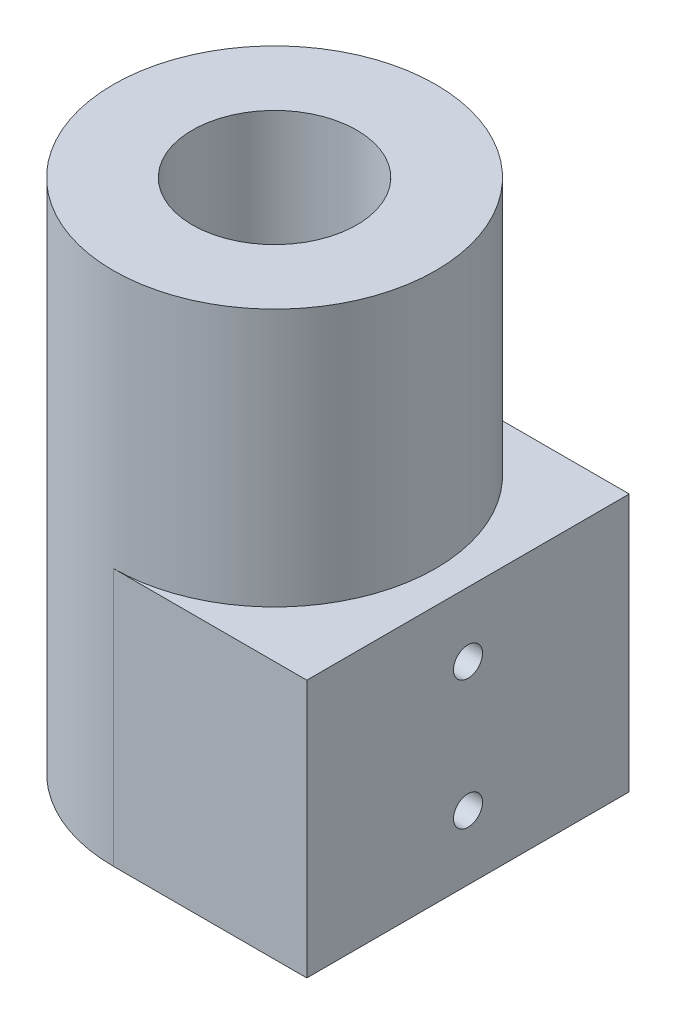
ISO-10303-21;
HEADER;
FILE_DESCRIPTION(('STEP AP214'),'2;1');
FILE_NAME('part.step','',(''),(''),'','','');
FILE_SCHEMA(('AUTOMOTIVE_DESIGN { 1 0 10303 214 1 1 1 1 }'));
ENDSEC;
DATA;
#1=APPLICATION_CONTEXT('core data for automotive mechanical design processes');
#2=APPLICATION_PROTOCOL_DEFINITION('international standard','automotive_design',2000,#1);
#3=PRODUCT_CONTEXT('',#1,'mechanical');
#4=PRODUCT('Part','Part','',(#3));
#5=PRODUCT_RELATED_PRODUCT_CATEGORY('part','',(#4));
#6=PRODUCT_DEFINITION_FORMATION('','',#4);
#7=PRODUCT_DEFINITION_CONTEXT('part definition',#1,'design');
#8=PRODUCT_DEFINITION('design','',#6,#7);
#9=PRODUCT_DEFINITION_SHAPE('','',#8);
#10=(LENGTH_UNIT() NAMED_UNIT(*) SI_UNIT(.MILLI.,.METRE.));
#11=(NAMED_UNIT(*) PLANE_ANGLE_UNIT() SI_UNIT($,.RADIAN.));
#12=(NAMED_UNIT(*) SI_UNIT($,.STERADIAN.) SOLID_ANGLE_UNIT());
#13=UNCERTAINTY_MEASURE_WITH_UNIT(LENGTH_MEASURE(1.E-05),#10,'distance_accuracy_value','');
#14=(GEOMETRIC_REPRESENTATION_CONTEXT(3) GLOBAL_UNCERTAINTY_ASSIGNED_CONTEXT((#13)) GLOBAL_UNIT_ASSIGNED_CONTEXT((#10,
#11,#12)) REPRESENTATION_CONTEXT('',''));
#15=CARTESIAN_POINT('',(0.,0.,0.));
#16=DIRECTION('',(0.,0.,1.));
#17=DIRECTION('',(1.,0.,0.));
#18=AXIS2_PLACEMENT_3D('',#15,#16,#17);
#19=CARTESIAN_POINT('',(0.,80.,0.));
#20=DIRECTION('',(0.,-1.,0.));
#21=DIRECTION('',(0.,0.,-1.));
#22=AXIS2_PLACEMENT_3D('',#19,#20,#21);
#23=CYLINDRICAL_SURFACE('',#22,25.);
#24=CARTESIAN_POINT('',(0.,80.,0.));
#25=DIRECTION('',(0.,1.,0.));
#26=DIRECTION('',(0.,0.,1.));
#27=AXIS2_PLACEMENT_3D('',#24,#25,#26);
#28=CIRCLE('',#27,25.);
#29=CARTESIAN_POINT('',(0.,80.,25.));
#30=VERTEX_POINT('',#29);
#31=EDGE_CURVE('E11',#30,#30,#28,.T.);
#32=ORIENTED_EDGE('',*,*,#31,.F.);
#33=EDGE_LOOP('',(#32));
#34=FACE_BOUND('',#33,.T.);
#35=CARTESIAN_POINT('',(-25.,8.6,0.));
#36=CARTESIAN_POINT('',(-24.9999994770471,8.60000346301199,-0.0785725456920296));
#37=CARTESIAN_POINT('',(-24.9996256167221,8.60663684055224,-0.15720049377424));
#38=CARTESIAN_POINT('',(-24.9981701556196,8.63300411119065,-0.312286405545781));
#39=CARTESIAN_POINT('',(-24.9970877255648,8.65275335488369,-0.388741716949364));
#40=CARTESIAN_POINT('',(-24.9943376103228,8.7047843242062,-0.537213404531629));
#41=CARTESIAN_POINT('',(-24.9926702281788,8.73705956147251,-0.609232056520927));
#42=CARTESIAN_POINT('',(-24.9889378814737,8.81321612143035,-0.746810262159747));
#43=CARTESIAN_POINT('',(-24.9868730095291,8.85709474138223,-0.812371315083188));
#44=CARTESIAN_POINT('',(-24.9825750435397,8.95527212765631,-0.935273182744505));
#45=CARTESIAN_POINT('',(-24.9803417700047,9.00958211035557,-0.992605031979624));
#46=CARTESIAN_POINT('',(-24.9759602441916,9.12705777265316,-1.09734450674776));
#47=CARTESIAN_POINT('',(-24.9738119954254,9.19022381753946,-1.14475172271603));
#48=CARTESIAN_POINT('',(-24.9698414422102,9.32366760915225,-1.2283225093171));
#49=CARTESIAN_POINT('',(-24.9680193480482,9.39394989866037,-1.26447883699938));
#50=CARTESIAN_POINT('',(-24.9649088407357,9.53959921214972,-1.32447510251908));
#51=CARTESIAN_POINT('',(-24.9636204227727,9.61496619027024,-1.34831515142481));
#52=CARTESIAN_POINT('',(-24.9617242315654,9.76856088418906,-1.38297779131245));
#53=CARTESIAN_POINT('',(-24.9611157389655,9.84678548595285,-1.3938141410061));
#54=CARTESIAN_POINT('',(-24.9606458607984,10.0039455847501,-1.40220423996859));
#55=CARTESIAN_POINT('',(-24.9607844681756,10.082881075063,-1.39975811467641));
#56=CARTESIAN_POINT('',(-24.9617924910775,10.2391286389441,-1.38166413872739));
#57=CARTESIAN_POINT('',(-24.9626610831328,10.3164424411975,-1.3660311636084));
#58=CARTESIAN_POINT('',(-24.9650298859841,10.4673467516623,-1.32203031283832));
#59=CARTESIAN_POINT('',(-24.9665300999545,10.5409372411587,-1.29366237318317));
#60=CARTESIAN_POINT('',(-24.9699940185082,10.6823538289402,-1.22497991182953));
#61=CARTESIAN_POINT('',(-24.9719579854857,10.7501766341769,-1.18465862354213));
#62=CARTESIAN_POINT('',(-24.9761278011031,10.8780966041388,-1.09321895468435));
#63=CARTESIAN_POINT('',(-24.9783336519081,10.9381936997033,-1.0421004774679));
#64=CARTESIAN_POINT('',(-24.9827422892366,11.0490428798302,-0.930433625776513));
#65=CARTESIAN_POINT('',(-24.9849450673679,11.0997819925993,-0.869872373260685));
#66=CARTESIAN_POINT('',(-24.9890963804967,11.1903749081129,-0.741084289756699));
#67=CARTESIAN_POINT('',(-24.9910449154206,11.2302287077084,-0.67285745655096));
#68=CARTESIAN_POINT('',(-24.9944682697842,11.2979185167894,-0.530667205127063));
#69=CARTESIAN_POINT('',(-24.995943070691,11.3257540561279,-0.456703562621918));
#70=CARTESIAN_POINT('',(-24.9982524954146,11.3686086331204,-0.305142680913347));
#71=CARTESIAN_POINT('',(-24.9990871252373,11.383627791015,-0.227545475806457));
#72=CARTESIAN_POINT('',(-25.000021377392,11.4004072399735,-0.0710327509757348));
#73=CARTESIAN_POINT('',(-25.0001219941671,11.4021854699557,0.00788083987705109));
#74=CARTESIAN_POINT('',(-24.9995795237541,11.3924794260874,0.164885241356442));
#75=CARTESIAN_POINT('',(-24.9989364396628,11.3809952074636,0.242976055407845));
#76=CARTESIAN_POINT('',(-24.9969796229889,11.3451051113309,0.396067803995062));
#77=CARTESIAN_POINT('',(-24.9956663164697,11.3207074425955,0.471070668859428));
#78=CARTESIAN_POINT('',(-24.992516865688,11.259691335015,0.615916979878095));
#79=CARTESIAN_POINT('',(-24.9906807176469,11.2230728078475,0.685760388739598));
#80=CARTESIAN_POINT('',(-24.9866895539892,11.1386086388922,0.81838746012404));
#81=CARTESIAN_POINT('',(-24.9845341983232,11.0907509919199,0.881163466705799));
#82=CARTESIAN_POINT('',(-24.9801484142045,10.985184596317,0.997796733376347));
#83=CARTESIAN_POINT('',(-24.977917985154,10.9274757692459,1.05165392244196));
#84=CARTESIAN_POINT('',(-24.9736305853416,10.8037678816953,1.14898131051293));
#85=CARTESIAN_POINT('',(-24.971573810288,10.73775967088,1.19243988878364));
#86=CARTESIAN_POINT('',(-24.9678687519951,10.599372867213,1.26765697426338));
#87=CARTESIAN_POINT('',(-24.9662204666414,10.5269943073391,1.29941554203602));
#88=CARTESIAN_POINT('',(-24.9635196667978,10.37796414483,1.35031089705506));
#89=CARTESIAN_POINT('',(-24.9624668046925,10.3013150641516,1.3694550498305));
#90=CARTESIAN_POINT('',(-24.9610746105225,10.1458844736079,1.39460221683919));
#91=CARTESIAN_POINT('',(-24.9607352730386,10.0671029799425,1.40060533087653));
#92=CARTESIAN_POINT('',(-24.9608085265533,9.90975948777058,1.39929907214853));
#93=CARTESIAN_POINT('',(-24.961220085317,9.83119733640853,1.3920079745491));
#94=CARTESIAN_POINT('',(-24.9627465652884,9.67641448103734,1.36435808925323));
#95=CARTESIAN_POINT('',(-24.9638614878088,9.60019378139859,1.34399927716712));
#96=CARTESIAN_POINT('',(-24.9666688007615,9.45225416311912,1.29079580066183));
#97=CARTESIAN_POINT('',(-24.968361192061,9.38053525123854,1.25795111749368));
#98=CARTESIAN_POINT('',(-24.972132667135,9.24362795255718,1.18071103832365));
#99=CARTESIAN_POINT('',(-24.974211739882,9.17843937960291,1.13631597170623));
#100=CARTESIAN_POINT('',(-24.9785255667867,9.05635115600124,1.03716868602244));
#101=CARTESIAN_POINT('',(-24.9807605141757,8.99946207387289,0.982403461994249));
#102=CARTESIAN_POINT('',(-24.9851326917253,8.89566646521388,0.864084050265081));
#103=CARTESIAN_POINT('',(-24.9872698977719,8.84876239178806,0.800527709085647));
#104=CARTESIAN_POINT('',(-24.9912075753829,8.76624063779481,0.666370196067375));
#105=CARTESIAN_POINT('',(-24.9930076795517,8.730635242258,0.595761465064418));
#106=CARTESIAN_POINT('',(-24.9960631061218,8.67182785019289,0.449610257482984));
#107=CARTESIAN_POINT('',(-24.997319069207,8.64861125929891,0.374073704323801));
#108=CARTESIAN_POINT('',(-24.9988138809483,8.6213051572501,0.248392552407416));
#109=CARTESIAN_POINT('',(-24.9992567108924,8.61332598242685,0.199061275313761));
#110=CARTESIAN_POINT('',(-24.999849936401,8.60267230649084,0.0998274543010612));
#111=CARTESIAN_POINT('',(-25.0000003322837,8.59999779960591,0.0499249110036888));
#112=CARTESIAN_POINT('',(-25.,8.6,0.));
#113=B_SPLINE_CURVE_WITH_KNOTS('',3,(#35,#36,#37,#38,#39,#40,#41,#42,#43,#44,#45,#46,#47,#48,
#49,#50,#51,#52,#53,#54,#55,#56,#57,#58,#59,#60,#61,#62,#63,#64,#65,#66,#67,#68,#69,#70,#71,#72,
#73,#74,#75,#76,#77,#78,#79,#80,#81,#82,#83,#84,#85,#86,#87,#88,#89,#90,#91,#92,#93,#94,#95,#96,
#97,#98,#99,#100,#101,#102,#103,#104,#105,#106,#107,#108,#109,#110,#111,#112),.UNSPECIFIED.,.T.,
.F.,(4,2,2,2,2,2,2,2,2,2,2,2,2,2,2,2,2,2,2,2,2,2,2,2,2,2,2,2,2,2,2,2,2,2,2,2,2,2,4),(0.,
0.235535387574193,0.471346928863845,0.707036484366522,0.942671189719634,1.1785606954627,
1.4144599338567,1.65051072370557,1.88655938480911,2.12235807110945,2.35815453054377,
2.59368535294608,2.82921735910502,3.06488295138684,3.30055065321023,3.53654261574743,
3.77253464655512,4.00853590839084,4.24453495608729,4.48021421205424,4.71589248662128,
4.95142112571857,5.18695146706179,5.4227345462023,5.65851950286266,5.89456673778133,
6.13061275081413,6.36652081467799,6.60242708685165,6.83800930999776,7.07359197283744,
7.30917498943287,7.54475128859902,7.78062499866744,8.01655659119655,8.25274383963552,
8.48865223505181,8.63831132977422,8.78797026164784),.UNSPECIFIED.);
#114=CARTESIAN_POINT('',(-25.,8.6,0.));
#115=VERTEX_POINT('',#114);
#116=EDGE_CURVE('E105',#115,#115,#113,.T.);
#117=ORIENTED_EDGE('',*,*,#116,.T.);
#118=EDGE_LOOP('',(#117));
#119=FACE_BOUND('',#118,.T.);
#120=CARTESIAN_POINT('',(-25.,28.6,0.));
#121=CARTESIAN_POINT('',(-24.9999994770471,28.600003463012,-0.0785725456920297));
#122=CARTESIAN_POINT('',(-24.9996256167221,28.6066368405522,-0.15720049377424));
#123=CARTESIAN_POINT('',(-24.9981701556196,28.6330041111907,-0.312286405545781));
#124=CARTESIAN_POINT('',(-24.9970877255648,28.6527533548837,-0.388741716949364));
#125=CARTESIAN_POINT('',(-24.9943376103228,28.7047843242062,-0.537213404531629));
#126=CARTESIAN_POINT('',(-24.9926702281788,28.7370595614725,-0.609232056520928));
#127=CARTESIAN_POINT('',(-24.9889378814737,28.8132161214304,-0.746810262159748));
#128=CARTESIAN_POINT('',(-24.9868730095291,28.8570947413822,-0.812371315083188));
#129=CARTESIAN_POINT('',(-24.9825750435397,28.9552721276563,-0.935273182744505));
#130=CARTESIAN_POINT('',(-24.9803417700047,29.0095821103556,-0.992605031979624));
#131=CARTESIAN_POINT('',(-24.9759602441916,29.1270577726532,-1.09734450674776));
#132=CARTESIAN_POINT('',(-24.9738119954254,29.1902238175395,-1.14475172271602));
#133=CARTESIAN_POINT('',(-24.9698414422102,29.3236676091522,-1.2283225093171));
#134=CARTESIAN_POINT('',(-24.9680193480482,29.3939498986604,-1.26447883699938));
#135=CARTESIAN_POINT('',(-24.9649088407357,29.5395992121497,-1.32447510251908));
#136=CARTESIAN_POINT('',(-24.9636204227727,29.6149661902702,-1.34831515142481));
#137=CARTESIAN_POINT('',(-24.9617242315654,29.7685608841891,-1.38297779131245));
#138=CARTESIAN_POINT('',(-24.9611157389655,29.8467854859529,-1.39381414100609));
#139=CARTESIAN_POINT('',(-24.9606458607984,30.0039455847501,-1.40220423996859));
#140=CARTESIAN_POINT('',(-24.9607844681756,30.082881075063,-1.39975811467641));
#141=CARTESIAN_POINT('',(-24.9617924910775,30.2391286389441,-1.38166413872738));
#142=CARTESIAN_POINT('',(-24.9626610831328,30.3164424411975,-1.36603116360839));
#143=CARTESIAN_POINT('',(-24.9650298859841,30.4673467516623,-1.32203031283832));
#144=CARTESIAN_POINT('',(-24.9665300999545,30.5409372411587,-1.29366237318317));
#145=CARTESIAN_POINT('',(-24.9699940185082,30.6823538289402,-1.22497991182953));
#146=CARTESIAN_POINT('',(-24.9719579854857,30.7501766341769,-1.18465862354213));
#147=CARTESIAN_POINT('',(-24.9761278011031,30.8780966041388,-1.09321895468435));
#148=CARTESIAN_POINT('',(-24.9783336519081,30.9381936997033,-1.04210047746789));
#149=CARTESIAN_POINT('',(-24.9827422892366,31.0490428798302,-0.930433625776509));
#150=CARTESIAN_POINT('',(-24.9849450673679,31.0997819925993,-0.86987237326068));
#151=CARTESIAN_POINT('',(-24.9890963804967,31.1903749081129,-0.741084289756695));
#152=CARTESIAN_POINT('',(-24.9910449154206,31.2302287077084,-0.672857456550956));
#153=CARTESIAN_POINT('',(-24.9944682697842,31.2979185167894,-0.53066720512706));
#154=CARTESIAN_POINT('',(-24.995943070691,31.3257540561279,-0.456703562621915));
#155=CARTESIAN_POINT('',(-24.9982524954146,31.3686086331204,-0.305142680913344));
#156=CARTESIAN_POINT('',(-24.9990871252373,31.383627791015,-0.227545475806453));
#157=CARTESIAN_POINT('',(-25.000021377392,31.4004072399735,-0.0710327509757292));
#158=CARTESIAN_POINT('',(-25.0001219941671,31.4021854699557,0.00788083987705693));
#159=CARTESIAN_POINT('',(-24.9995795237541,31.3924794260874,0.164885241356447));
#160=CARTESIAN_POINT('',(-24.9989364396628,31.3809952074636,0.24297605540785));
#161=CARTESIAN_POINT('',(-24.9969796229889,31.3451051113309,0.396067803995069));
#162=CARTESIAN_POINT('',(-24.9956663164697,31.3207074425955,0.471070668859436));
#163=CARTESIAN_POINT('',(-24.9925168656881,31.259691335015,0.615916979878103));
#164=CARTESIAN_POINT('',(-24.9906807176469,31.2230728078475,0.685760388739604));
#165=CARTESIAN_POINT('',(-24.9866895539892,31.1386086388921,0.818387460124044));
#166=CARTESIAN_POINT('',(-24.9845341983232,31.0907509919199,0.881163466705804));
#167=CARTESIAN_POINT('',(-24.9801484142045,30.985184596317,0.997796733376351));
#168=CARTESIAN_POINT('',(-24.977917985154,30.9274757692459,1.05165392244197));
#169=CARTESIAN_POINT('',(-24.9736305853416,30.8037678816953,1.14898131051293));
#170=CARTESIAN_POINT('',(-24.971573810288,30.73775967088,1.19243988878365));
#171=CARTESIAN_POINT('',(-24.9678687519951,30.599372867213,1.26765697426338));
#172=CARTESIAN_POINT('',(-24.9662204666414,30.5269943073391,1.29941554203603));
#173=CARTESIAN_POINT('',(-24.9635196667978,30.37796414483,1.35031089705506));
#174=CARTESIAN_POINT('',(-24.9624668046925,30.3013150641516,1.3694550498305));
#175=CARTESIAN_POINT('',(-24.9610746105225,30.1458844736079,1.39460221683919));
#176=CARTESIAN_POINT('',(-24.9607352730386,30.0671029799425,1.40060533087654));
#177=CARTESIAN_POINT('',(-24.9608085265533,29.9097594877706,1.39929907214853));
#178=CARTESIAN_POINT('',(-24.961220085317,29.8311973364085,1.3920079745491));
#179=CARTESIAN_POINT('',(-24.9627465652884,29.6764144810373,1.36435808925323));
#180=CARTESIAN_POINT('',(-24.9638614878088,29.6001937813986,1.34399927716712));
#181=CARTESIAN_POINT('',(-24.9666688007615,29.4522541631191,1.29079580066183));
#182=CARTESIAN_POINT('',(-24.968361192061,29.3805352512385,1.25795111749368));
#183=CARTESIAN_POINT('',(-24.972132667135,29.2436279525572,1.18071103832365));
#184=CARTESIAN_POINT('',(-24.974211739882,29.1784393796029,1.13631597170623));
#185=CARTESIAN_POINT('',(-24.9785255667867,29.0563511560012,1.03716868602243));
#186=CARTESIAN_POINT('',(-24.9807605141757,28.9994620738729,0.982403461994246));
#187=CARTESIAN_POINT('',(-24.9851326917253,28.8956664652139,0.864084050265079));
#188=CARTESIAN_POINT('',(-24.9872698977719,28.8487623917881,0.800527709085648));
#189=CARTESIAN_POINT('',(-24.9912075753829,28.7662406377948,0.666370196067377));
#190=CARTESIAN_POINT('',(-24.9930076795517,28.730635242258,0.59576146506442));
#191=CARTESIAN_POINT('',(-24.9960631061218,28.6718278501929,0.449610257482984));
#192=CARTESIAN_POINT('',(-24.997319069207,28.6486112592989,0.374073704323801));
#193=CARTESIAN_POINT('',(-24.9988138809483,28.6213051572501,0.248392552407416));
#194=CARTESIAN_POINT('',(-24.9992567108924,28.6133259824268,0.199061275313761));
#195=CARTESIAN_POINT('',(-24.999849936401,28.6026723064908,0.099827454301062));
#196=CARTESIAN_POINT('',(-25.0000003322837,28.5999977996059,0.0499249110036893));
#197=CARTESIAN_POINT('',(-25.,28.6,0.));
#198=B_SPLINE_CURVE_WITH_KNOTS('',3,(#120,#121,#122,#123,#124,#125,#126,#127,#128,#129,#130,
#131,#132,#133,#134,#135,#136,#137,#138,#139,#140,#141,#142,#143,#144,#145,#146,#147,#148,#149,
#150,#151,#152,#153,#154,#155,#156,#157,#158,#159,#160,#161,#162,#163,#164,#165,#166,#167,#168,
#169,#170,#171,#172,#173,#174,#175,#176,#177,#178,#179,#180,#181,#182,#183,#184,#185,#186,#187,
#188,#189,#190,#191,#192,#193,#194,#195,#196,#197),.UNSPECIFIED.,.T.,.F.,(4,2,2,2,2,2,2,2,2,2,2,
2,2,2,2,2,2,2,2,2,2,2,2,2,2,2,2,2,2,2,2,2,2,2,2,2,2,2,4),(0.,0.235535387574193,
0.471346928863846,0.707036484366524,0.942671189719635,1.1785606954627,1.4144599338567,
1.65051072370557,1.88655938480911,2.12235807110945,2.35815453054377,2.59368535294607,
2.82921735910502,3.06488295138684,3.30055065321023,3.53654261574743,3.77253464655511,
4.00853590839083,4.24453495608729,4.48021421205423,4.71589248662128,4.95142112571858,
5.18695146706179,5.4227345462023,5.65851950286266,5.89456673778134,6.13061275081413,
6.36652081467798,6.60242708685164,6.83800930999775,7.07359197283743,7.30917498943286,
7.54475128859902,7.78062499866744,8.01655659119655,8.25274383963551,8.48865223505181,
8.63831132977421,8.78797026164784),.UNSPECIFIED.);
#199=CARTESIAN_POINT('',(-25.,28.6,0.));
#200=VERTEX_POINT('',#199);
#201=EDGE_CURVE('E112',#200,#200,#198,.T.);
#202=ORIENTED_EDGE('',*,*,#201,.T.);
#203=EDGE_LOOP('',(#202));
#204=FACE_BOUND('',#203,.T.);
#205=DIRECTION('',(0.,-1.,0.));
#206=VECTOR('',#205,1.);
#207=CARTESIAN_POINT('',(0.,80.,25.));
#208=LINE('',#207,#206);
#209=CARTESIAN_POINT('',(0.,0.,25.));
#210=VERTEX_POINT('',#209);
#211=CARTESIAN_POINT('',(0.,40.,25.));
#212=VERTEX_POINT('',#211);
#213=EDGE_CURVE('E55',#210,#212,#208,.F.);
#214=ORIENTED_EDGE('',*,*,#213,.T.);
#215=CARTESIAN_POINT('',(0.,40.,0.));
#216=DIRECTION('',(0.,1.,0.));
#217=DIRECTION('',(0.,0.,1.));
#218=AXIS2_PLACEMENT_3D('',#215,#216,#217);
#219=CIRCLE('',#218,25.);
#220=CARTESIAN_POINT('',(0.,40.,-25.));
#221=VERTEX_POINT('',#220);
#222=EDGE_CURVE('E60',#221,#212,#219,.F.);
#223=ORIENTED_EDGE('',*,*,#222,.F.);
#224=DIRECTION('',(0.,-1.,0.));
#225=VECTOR('',#224,1.);
#226=CARTESIAN_POINT('',(0.,80.,-25.));
#227=LINE('',#226,#225);
#228=CARTESIAN_POINT('',(0.,0.,-25.));
#229=VERTEX_POINT('',#228);
#230=EDGE_CURVE('E90',#229,#221,#227,.F.);
#231=ORIENTED_EDGE('',*,*,#230,.F.);
#232=CARTESIAN_POINT('',(0.,0.,0.));
#233=DIRECTION('',(0.,1.,0.));
#234=DIRECTION('',(0.,0.,1.));
#235=AXIS2_PLACEMENT_3D('',#232,#233,#234);
#236=CIRCLE('',#235,25.);
#237=EDGE_CURVE('E47',#229,#210,#236,.T.);
#238=ORIENTED_EDGE('',*,*,#237,.T.);
#239=EDGE_LOOP('',(#214,#223,#231,#238));
#240=FACE_BOUND('',#239,.T.);
#241=ADVANCED_FACE('F33',(#34,#119,#204,#240),#23,.T.);
#242=CARTESIAN_POINT('',(0.,80.,0.));
#243=DIRECTION('',(0.,1.,0.));
#244=DIRECTION('',(0.,0.,1.));
#245=AXIS2_PLACEMENT_3D('',#242,#243,#244);
#246=PLANE('',#245);
#247=CARTESIAN_POINT('',(0.,80.,0.));
#248=DIRECTION('',(0.,1.,0.));
#249=DIRECTION('',(0.,0.,1.));
#250=AXIS2_PLACEMENT_3D('',#247,#248,#249);
#251=CIRCLE('',#250,12.75);
#252=CARTESIAN_POINT('',(0.,80.,12.75));
#253=VERTEX_POINT('',#252);
#254=EDGE_CURVE('E133',#253,#253,#251,.T.);
#255=ORIENTED_EDGE('',*,*,#254,.F.);
#256=EDGE_LOOP('',(#255));
#257=FACE_BOUND('',#256,.T.);
#258=ORIENTED_EDGE('',*,*,#31,.T.);
#259=EDGE_LOOP('',(#258));
#260=FACE_BOUND('',#259,.T.);
#261=ADVANCED_FACE('F144',(#257,#260),#246,.T.);
#262=CARTESIAN_POINT('',(0.,0.,0.));
#263=DIRECTION('',(0.,1.,0.));
#264=DIRECTION('',(0.,0.,1.));
#265=AXIS2_PLACEMENT_3D('',#262,#263,#264);
#266=PLANE('',#265);
#267=CARTESIAN_POINT('',(0.,0.,0.));
#268=DIRECTION('',(0.,1.,0.));
#269=DIRECTION('',(0.,0.,1.));
#270=AXIS2_PLACEMENT_3D('',#267,#268,#269);
#271=CIRCLE('',#270,12.75);
#272=CARTESIAN_POINT('',(0.,0.,12.75));
#273=VERTEX_POINT('',#272);
#274=EDGE_CURVE('E87',#273,#273,#271,.T.);
#275=ORIENTED_EDGE('',*,*,#274,.T.);
#276=EDGE_LOOP('',(#275));
#277=FACE_BOUND('',#276,.T.);
#278=ORIENTED_EDGE('',*,*,#237,.F.);
#279=DIRECTION('',(-1.,0.,0.));
#280=VECTOR('',#279,1.);
#281=CARTESIAN_POINT('',(30.,0.,-25.));
#282=LINE('',#281,#280);
#283=CARTESIAN_POINT('',(30.,0.,-25.));
#284=VERTEX_POINT('',#283);
#285=EDGE_CURVE('E83',#284,#229,#282,.T.);
#286=ORIENTED_EDGE('',*,*,#285,.F.);
#287=DIRECTION('',(0.,0.,-1.));
#288=VECTOR('',#287,1.);
#289=CARTESIAN_POINT('',(30.,0.,-25.));
#290=LINE('',#289,#288);
#291=CARTESIAN_POINT('',(30.,0.,25.));
#292=VERTEX_POINT('',#291);
#293=EDGE_CURVE('E214',#292,#284,#290,.T.);
#294=ORIENTED_EDGE('',*,*,#293,.F.);
#295=DIRECTION('',(-1.,0.,0.));
#296=VECTOR('',#295,1.);
#297=CARTESIAN_POINT('',(30.,0.,25.));
#298=LINE('',#297,#296);
#299=EDGE_CURVE('E86',#292,#210,#298,.T.);
#300=ORIENTED_EDGE('',*,*,#299,.T.);
#301=EDGE_LOOP('',(#278,#286,#294,#300));
#302=FACE_BOUND('',#301,.T.);
#303=ADVANCED_FACE('F81',(#277,#302),#266,.F.);
#304=CARTESIAN_POINT('',(0.,0.,0.));
#305=DIRECTION('',(0.,1.,0.));
#306=DIRECTION('',(0.,0.,1.));
#307=AXIS2_PLACEMENT_3D('',#304,#305,#306);
#308=CYLINDRICAL_SURFACE('',#307,12.75);
#309=CARTESIAN_POINT('',(-12.6729041659755,30.,-1.4));
#310=CARTESIAN_POINT('',(-12.6729051682961,29.9216161292853,-1.39999662610907));
#311=CARTESIAN_POINT('',(-12.6736392334842,29.8431814670977,-1.39339492314486));
#312=CARTESIAN_POINT('',(-12.6764955166706,29.6884897744029,-1.36716085329439));
#313=CARTESIAN_POINT('',(-12.678619235446,29.6122351913349,-1.34751439819555));
#314=CARTESIAN_POINT('',(-12.6840114379454,29.4641660455808,-1.29577244401));
#315=CARTESIAN_POINT('',(-12.687279197215,29.3923487068253,-1.26368482181434));
#316=CARTESIAN_POINT('',(-12.6945904026583,29.255133499828,-1.18798718284299));
#317=CARTESIAN_POINT('',(-12.6986337026109,29.189734424989,-1.14437933751685));
#318=CARTESIAN_POINT('',(-12.7070601251236,29.066912777586,-1.04667545710026));
#319=CARTESIAN_POINT('',(-12.7114445048353,29.0095221248994,-0.992539400468784));
#320=CARTESIAN_POINT('',(-12.7200477101026,28.9046216302596,-0.875401638720422));
#321=CARTESIAN_POINT('',(-12.7242665278387,28.8571122545453,-0.812399515501498));
#322=CARTESIAN_POINT('',(-12.7320758760998,28.7732108411907,-0.679120315846597));
#323=CARTESIAN_POINT('',(-12.7356647850152,28.7368473226104,-0.608825183102066));
#324=CARTESIAN_POINT('',(-12.7417962045812,28.6764523710481,-0.463080374864275));
#325=CARTESIAN_POINT('',(-12.7443387455985,28.6524205801805,-0.387630849031372));
#326=CARTESIAN_POINT('',(-12.7480821164712,28.6174656145163,-0.23404327172931));
#327=CARTESIAN_POINT('',(-12.7492883402893,28.6064897270306,-0.155917350687369));
#328=CARTESIAN_POINT('',(-12.7502415427382,28.5977949342199,0.00107632026491309));
#329=CARTESIAN_POINT('',(-12.7499885663789,28.6000756199876,0.0799440472188647));
#330=CARTESIAN_POINT('',(-12.7480562676724,28.6177866447421,0.23582443365428));
#331=CARTESIAN_POINT('',(-12.746383094032,28.6331602990268,0.312843620505868));
#332=CARTESIAN_POINT('',(-12.7418054087678,28.6765324409338,0.463202026726311));
#333=CARTESIAN_POINT('',(-12.7389008783697,28.7045311210492,0.536541189967117));
#334=CARTESIAN_POINT('',(-12.7321763596477,28.7724199997285,0.677635230835173));
#335=CARTESIAN_POINT('',(-12.7283544592002,28.8123350792147,0.745378041917743));
#336=CARTESIAN_POINT('',(-12.7202235950991,28.9029056374499,0.873224755943987));
#337=CARTESIAN_POINT('',(-12.7159146142092,28.9535614963366,0.933328388401428));
#338=CARTESIAN_POINT('',(-12.7072658321211,29.0644940004057,1.04452300994864));
#339=CARTESIAN_POINT('',(-12.7029259882536,29.1248199904619,1.09556477987316));
#340=CARTESIAN_POINT('',(-12.6947271967031,29.2532098193592,1.18680519499319));
#341=CARTESIAN_POINT('',(-12.690868249975,29.3212736735645,1.22700381865825));
#342=CARTESIAN_POINT('',(-12.6840679976125,29.463247175661,1.29541772310474));
#343=CARTESIAN_POINT('',(-12.6811269500889,29.5371584605231,1.32362963406006));
#344=CARTESIAN_POINT('',(-12.67650073599,29.688708569209,1.36722862017466));
#345=CARTESIAN_POINT('',(-12.6748155230781,29.76634725539,1.38261616851866));
#346=CARTESIAN_POINT('',(-12.6728999942678,29.9227152455206,1.40006563846638));
#347=CARTESIAN_POINT('',(-12.6726621443143,30.0014367602033,1.40219656693716));
#348=CARTESIAN_POINT('',(-12.6736483761638,30.158115702988,1.39325384605445));
#349=CARTESIAN_POINT('',(-12.674872434064,30.2360731435619,1.38218041259845));
#350=CARTESIAN_POINT('',(-12.6786377012726,30.3888078051838,1.34720117272316));
#351=CARTESIAN_POINT('',(-12.681175531403,30.4635926551126,1.32332828243036));
#352=CARTESIAN_POINT('',(-12.687279656894,30.6080969609216,1.26346149776211));
#353=CARTESIAN_POINT('',(-12.6908459804733,30.677816277754,1.22746727081158));
#354=CARTESIAN_POINT('',(-12.6986234318308,30.8105241287661,1.1442078622847));
#355=CARTESIAN_POINT('',(-12.7028371404722,30.8734839289681,1.09689712628336));
#356=CARTESIAN_POINT('',(-12.7114262700609,30.9905935094011,0.992412641028189));
#357=CARTESIAN_POINT('',(-12.7158016958397,31.0447430261545,0.935238596910627));
#358=CARTESIAN_POINT('',(-12.7242441567494,31.1429345295673,0.812350321107717));
#359=CARTESIAN_POINT('',(-12.7283097628284,31.1869313785432,0.746599911043993));
#360=CARTESIAN_POINT('',(-12.7356535006815,31.2632574066592,0.608602995121102));
#361=CARTESIAN_POINT('',(-12.7389316451488,31.2955867738732,0.536356593997424));
#362=CARTESIAN_POINT('',(-12.7443246935253,31.3475843531244,0.387573285598934));
#363=CARTESIAN_POINT('',(-12.7464420610483,31.3672793952894,0.31104584801351));
#364=CARTESIAN_POINT('',(-12.749285142352,31.3935367213161,0.155745722522444));
#365=CARTESIAN_POINT('',(-12.7500109038692,31.4000994556575,0.0769731117273655));
#366=CARTESIAN_POINT('',(-12.74998890283,31.3998987847258,-0.0801389185601781));
#367=CARTESIAN_POINT('',(-12.7492488689566,31.3932052755248,-0.158478437722097));
#368=CARTESIAN_POINT('',(-12.7463937089516,31.3668292279166,-0.312912631150896));
#369=CARTESIAN_POINT('',(-12.7442785823993,31.3471466855356,-0.389007304730993));
#370=CARTESIAN_POINT('',(-12.7389100533068,31.2953716294145,-0.536788004868579));
#371=CARTESIAN_POINT('',(-12.7356568832047,31.2632816496728,-0.608474928167987));
#372=CARTESIAN_POINT('',(-12.7283740156415,31.1876099461804,-0.745456527031009));
#373=CARTESIAN_POINT('',(-12.7243443176157,31.1440282140716,-0.810751197945436));
#374=CARTESIAN_POINT('',(-12.71593383921,31.0463490800581,-0.933452765953168));
#375=CARTESIAN_POINT('',(-12.7115513859012,30.9921995968253,-0.990818089409207));
#376=CARTESIAN_POINT('',(-12.7029432430047,30.8750275555113,-1.09567724045333));
#377=CARTESIAN_POINT('',(-12.6987175910868,30.8120028824716,-1.14316870840113));
#378=CARTESIAN_POINT('',(-12.6908879056701,30.6786571389222,-1.22704916558985));
#379=CARTESIAN_POINT('',(-12.6872857832393,30.6083146589675,-1.26340427596427));
#380=CARTESIAN_POINT('',(-12.681133581449,30.4625266240259,-1.32373680428964));
#381=CARTESIAN_POINT('',(-12.6785823315571,30.3870868564076,-1.3477280015204));
#382=CARTESIAN_POINT('',(-12.6754554359112,30.2593607044928,-1.37675586669011));
#383=CARTESIAN_POINT('',(-12.6745033209782,30.2078871725386,-1.38546027963109));
#384=CARTESIAN_POINT('',(-12.6732273542403,30.1042832530653,-1.39708345324692));
#385=CARTESIAN_POINT('',(-12.6729034990795,30.0521528690563,-1.40000224482524));
#386=CARTESIAN_POINT('',(-12.6729041659755,30.,-1.4));
#387=B_SPLINE_CURVE_WITH_KNOTS('',3,(#309,#310,#311,#312,#313,#314,#315,#316,#317,#318,#319,
#320,#321,#322,#323,#324,#325,#326,#327,#328,#329,#330,#331,#332,#333,#334,#335,#336,#337,#338,
#339,#340,#341,#342,#343,#344,#345,#346,#347,#348,#349,#350,#351,#352,#353,#354,#355,#356,#357,
#358,#359,#360,#361,#362,#363,#364,#365,#366,#367,#368,#369,#370,#371,#372,#373,#374,#375,#376,
#377,#378,#379,#380,#381,#382,#383,#384,#385,#386),.UNSPECIFIED.,.T.,.F.,(4,2,2,2,2,2,2,2,2,2,2,
2,2,2,2,2,2,2,2,2,2,2,2,2,2,2,2,2,2,2,2,2,2,2,2,2,2,2,4),(0.,0.234961134532208,
0.470176438580164,0.705243063023307,0.940265411277642,1.17619927239455,1.41214426330651,
1.64868802500084,1.88522492144661,2.12080353253398,2.35637487708944,2.59093149353702,
2.82549168637641,3.06054509726889,3.29560682855985,3.53190863354489,3.76821090773415,
4.00457956972746,4.24093950996242,4.47606805022465,4.71119274607803,4.94571565622721,
5.18024500154397,5.41573481832957,5.65123167630667,5.88775617962646,6.12427687012255,
6.36029361021345,6.59630225404461,6.83106981013201,7.0658374380429,7.30055714414659,
7.53527702096436,7.77118429818062,8.00714788755243,8.24382235156704,8.48023247412512,
8.63656518166623,8.79289705416563),.UNSPECIFIED.);
#388=CARTESIAN_POINT('',(-12.6729041659755,30.,-1.4));
#389=VERTEX_POINT('',#388);
#390=EDGE_CURVE('E37',#389,#389,#387,.T.);
#391=ORIENTED_EDGE('',*,*,#390,.T.);
#392=EDGE_LOOP('',(#391));
#393=FACE_BOUND('',#392,.T.);
#394=CARTESIAN_POINT('',(-12.6729041659755,10.,-1.4));
#395=CARTESIAN_POINT('',(-12.6729051682961,9.92161612928529,-1.39999662610908));
#396=CARTESIAN_POINT('',(-12.6736392334842,9.84318146709769,-1.39339492314487));
#397=CARTESIAN_POINT('',(-12.6764955166706,9.68848977440294,-1.3671608532944));
#398=CARTESIAN_POINT('',(-12.678619235446,9.61223519133486,-1.34751439819555));
#399=CARTESIAN_POINT('',(-12.6840114379454,9.46416604558081,-1.29577244401));
#400=CARTESIAN_POINT('',(-12.687279197215,9.3923487068253,-1.26368482181435));
#401=CARTESIAN_POINT('',(-12.6945904026583,9.25513349982804,-1.18798718284299));
#402=CARTESIAN_POINT('',(-12.6986337026109,9.18973442498898,-1.14437933751686));
#403=CARTESIAN_POINT('',(-12.7070601251236,9.06691277758596,-1.04667545710026));
#404=CARTESIAN_POINT('',(-12.7114445048353,9.00952212489936,-0.992539400468786));
#405=CARTESIAN_POINT('',(-12.7200477101026,8.90462163025959,-0.875401638720424));
#406=CARTESIAN_POINT('',(-12.7242665278387,8.85711225454526,-0.812399515501501));
#407=CARTESIAN_POINT('',(-12.7320758760998,8.77321084119072,-0.6791203158466));
#408=CARTESIAN_POINT('',(-12.7356647850152,8.73684732261042,-0.608825183102069));
#409=CARTESIAN_POINT('',(-12.7417962045812,8.67645237104809,-0.463080374864279));
#410=CARTESIAN_POINT('',(-12.7443387455985,8.65242058018053,-0.387630849031375));
#411=CARTESIAN_POINT('',(-12.7480821164712,8.61746561451627,-0.234043271729313));
#412=CARTESIAN_POINT('',(-12.7492883402893,8.60648972703056,-0.155917350687372));
#413=CARTESIAN_POINT('',(-12.7502415427382,8.59779493421988,0.00107632026491013));
#414=CARTESIAN_POINT('',(-12.7499885663789,8.60007561998757,0.0799440472188616));
#415=CARTESIAN_POINT('',(-12.7480562676724,8.61778664474212,0.235824433654276));
#416=CARTESIAN_POINT('',(-12.746383094032,8.63316029902676,0.312843620505864));
#417=CARTESIAN_POINT('',(-12.7418054087678,8.6765324409338,0.463202026726308));
#418=CARTESIAN_POINT('',(-12.7389008783697,8.7045311210492,0.536541189967114));
#419=CARTESIAN_POINT('',(-12.7321763596477,8.77241999972849,0.67763523083517));
#420=CARTESIAN_POINT('',(-12.7283544592002,8.81233507921473,0.74537804191774));
#421=CARTESIAN_POINT('',(-12.7202235950991,8.90290563744995,0.873224755943984));
#422=CARTESIAN_POINT('',(-12.7159146142092,8.95356149633655,0.933328388401425));
#423=CARTESIAN_POINT('',(-12.7072658321211,9.06449400040566,1.04452300994864));
#424=CARTESIAN_POINT('',(-12.7029259882536,9.12481999046189,1.09556477987316));
#425=CARTESIAN_POINT('',(-12.6947271967031,9.25320981935923,1.18680519499319));
#426=CARTESIAN_POINT('',(-12.690868249975,9.32127367356448,1.22700381865825));
#427=CARTESIAN_POINT('',(-12.6840679976125,9.46324717566099,1.29541772310474));
#428=CARTESIAN_POINT('',(-12.6811269500889,9.53715846052307,1.32362963406005));
#429=CARTESIAN_POINT('',(-12.67650073599,9.68870856920904,1.36722862017465));
#430=CARTESIAN_POINT('',(-12.6748155230781,9.76634725538997,1.38261616851866));
#431=CARTESIAN_POINT('',(-12.6728999942678,9.9227152455206,1.40006563846638));
#432=CARTESIAN_POINT('',(-12.6726621443143,10.0014367602033,1.40219656693716));
#433=CARTESIAN_POINT('',(-12.6736483761638,10.158115702988,1.39325384605445));
#434=CARTESIAN_POINT('',(-12.674872434064,10.2360731435619,1.38218041259845));
#435=CARTESIAN_POINT('',(-12.6786377012726,10.3888078051838,1.34720117272316));
#436=CARTESIAN_POINT('',(-12.681175531403,10.4635926551126,1.32332828243036));
#437=CARTESIAN_POINT('',(-12.687279656894,10.6080969609216,1.26346149776211));
#438=CARTESIAN_POINT('',(-12.6908459804733,10.677816277754,1.22746727081158));
#439=CARTESIAN_POINT('',(-12.6986234318308,10.8105241287661,1.1442078622847));
#440=CARTESIAN_POINT('',(-12.7028371404722,10.8734839289681,1.09689712628336));
#441=CARTESIAN_POINT('',(-12.7114262700609,10.9905935094011,0.992412641028184));
#442=CARTESIAN_POINT('',(-12.7158016958397,11.0447430261545,0.935238596910623));
#443=CARTESIAN_POINT('',(-12.7242441567494,11.1429345295673,0.812350321107714));
#444=CARTESIAN_POINT('',(-12.7283097628284,11.1869313785432,0.74659991104399));
#445=CARTESIAN_POINT('',(-12.7356535006815,11.2632574066592,0.608602995121101));
#446=CARTESIAN_POINT('',(-12.7389316451488,11.2955867738732,0.536356593997424));
#447=CARTESIAN_POINT('',(-12.7443246935253,11.3475843531244,0.387573285598934));
#448=CARTESIAN_POINT('',(-12.7464420610483,11.3672793952894,0.31104584801351));
#449=CARTESIAN_POINT('',(-12.749285142352,11.3935367213161,0.155745722522443));
#450=CARTESIAN_POINT('',(-12.7500109038692,11.4000994556575,0.0769731117273653));
#451=CARTESIAN_POINT('',(-12.74998890283,11.3998987847258,-0.0801389185601781));
#452=CARTESIAN_POINT('',(-12.7492488689566,11.3932052755249,-0.158478437722097));
#453=CARTESIAN_POINT('',(-12.7463937089516,11.3668292279166,-0.312912631150896));
#454=CARTESIAN_POINT('',(-12.7442785823993,11.3471466855356,-0.389007304730995));
#455=CARTESIAN_POINT('',(-12.7389100533068,11.2953716294145,-0.53678800486858));
#456=CARTESIAN_POINT('',(-12.7356568832047,11.2632816496729,-0.608474928167989));
#457=CARTESIAN_POINT('',(-12.7283740156415,11.1876099461804,-0.74545652703101));
#458=CARTESIAN_POINT('',(-12.7243443176157,11.1440282140716,-0.810751197945437));
#459=CARTESIAN_POINT('',(-12.71593383921,11.0463490800581,-0.93345276595317));
#460=CARTESIAN_POINT('',(-12.7115513859013,10.9921995968253,-0.990818089409209));
#461=CARTESIAN_POINT('',(-12.7029432430046,10.8750275555113,-1.09567724045333));
#462=CARTESIAN_POINT('',(-12.6987175910868,10.8120028824716,-1.14316870840113));
#463=CARTESIAN_POINT('',(-12.6908879056701,10.6786571389222,-1.22704916558985));
#464=CARTESIAN_POINT('',(-12.6872857832393,10.6083146589675,-1.26340427596427));
#465=CARTESIAN_POINT('',(-12.681133581449,10.4625266240259,-1.32373680428964));
#466=CARTESIAN_POINT('',(-12.6785823315571,10.3870868564076,-1.3477280015204));
#467=CARTESIAN_POINT('',(-12.6754554359112,10.2593607044928,-1.37675586669011));
#468=CARTESIAN_POINT('',(-12.6745033209782,10.2078871725386,-1.38546027963109));
#469=CARTESIAN_POINT('',(-12.6732273542403,10.1042832530653,-1.39708345324693));
#470=CARTESIAN_POINT('',(-12.6729034990795,10.0521528690563,-1.40000224482524));
#471=CARTESIAN_POINT('',(-12.6729041659755,10.,-1.4));
#472=B_SPLINE_CURVE_WITH_KNOTS('',3,(#394,#395,#396,#397,#398,#399,#400,#401,#402,#403,#404,
#405,#406,#407,#408,#409,#410,#411,#412,#413,#414,#415,#416,#417,#418,#419,#420,#421,#422,#423,
#424,#425,#426,#427,#428,#429,#430,#431,#432,#433,#434,#435,#436,#437,#438,#439,#440,#441,#442,
#443,#444,#445,#446,#447,#448,#449,#450,#451,#452,#453,#454,#455,#456,#457,#458,#459,#460,#461,
#462,#463,#464,#465,#466,#467,#468,#469,#470,#471),.UNSPECIFIED.,.T.,.F.,(4,2,2,2,2,2,2,2,2,2,2,
2,2,2,2,2,2,2,2,2,2,2,2,2,2,2,2,2,2,2,2,2,2,2,2,2,2,2,4),(0.,0.234961134532208,
0.470176438580164,0.705243063023309,0.940265411277645,1.17619927239455,1.41214426330651,
1.64868802500084,1.88522492144661,2.12080353253398,2.35637487708944,2.59093149353702,
2.82549168637641,3.06054509726888,3.29560682855985,3.53190863354489,3.76821090773415,
4.00457956972746,4.24093950996242,4.47606805022465,4.71119274607802,4.94571565622721,
5.18024500154397,5.41573481832957,5.65123167630668,5.88775617962646,6.12427687012255,
6.36029361021345,6.59630225404461,6.83106981013201,7.0658374380429,7.3005571441466,
7.53527702096436,7.77118429818063,8.00714788755243,8.24382235156705,8.48023247412512,
8.63656518166624,8.79289705416564),.UNSPECIFIED.);
#473=CARTESIAN_POINT('',(-12.6729041659755,10.,-1.4));
#474=VERTEX_POINT('',#473);
#475=EDGE_CURVE('E99',#474,#474,#472,.T.);
#476=ORIENTED_EDGE('',*,*,#475,.T.);
#477=EDGE_LOOP('',(#476));
#478=FACE_BOUND('',#477,.T.);
#479=ORIENTED_EDGE('',*,*,#274,.F.);
#480=EDGE_LOOP('',(#479));
#481=FACE_BOUND('',#480,.T.);
#482=ORIENTED_EDGE('',*,*,#254,.T.);
#483=EDGE_LOOP('',(#482));
#484=FACE_BOUND('',#483,.T.);
#485=ADVANCED_FACE('F121',(#393,#478,#481,#484),#308,.F.);
#486=CARTESIAN_POINT('',(-25.,10.,0.));
#487=DIRECTION('',(1.,0.,0.));
#488=DIRECTION('',(0.,0.,-1.));
#489=AXIS2_PLACEMENT_3D('',#486,#487,#488);
#490=CYLINDRICAL_SURFACE('',#489,1.4);
#491=ORIENTED_EDGE('',*,*,#475,.F.);
#492=EDGE_LOOP('',(#491));
#493=FACE_BOUND('',#492,.T.);
#494=ORIENTED_EDGE('',*,*,#116,.F.);
#495=EDGE_LOOP('',(#494));
#496=FACE_BOUND('',#495,.T.);
#497=ADVANCED_FACE('F117',(#493,#496),#490,.F.);
#498=CARTESIAN_POINT('',(-25.,30.,0.));
#499=DIRECTION('',(1.,0.,0.));
#500=DIRECTION('',(0.,0.,-1.));
#501=AXIS2_PLACEMENT_3D('',#498,#499,#500);
#502=CYLINDRICAL_SURFACE('',#501,1.4);
#503=ORIENTED_EDGE('',*,*,#390,.F.);
#504=EDGE_LOOP('',(#503));
#505=FACE_BOUND('',#504,.T.);
#506=ORIENTED_EDGE('',*,*,#201,.F.);
#507=EDGE_LOOP('',(#506));
#508=FACE_BOUND('',#507,.T.);
#509=ADVANCED_FACE('F120',(#505,#508),#502,.F.);
#510=CARTESIAN_POINT('',(30.,0.,25.));
#511=DIRECTION('',(0.,0.,-1.));
#512=DIRECTION('',(-1.,0.,0.));
#513=AXIS2_PLACEMENT_3D('',#510,#511,#512);
#514=PLANE('',#513);
#515=DIRECTION('',(-1.,0.,0.));
#516=VECTOR('',#515,1.);
#517=CARTESIAN_POINT('',(30.,40.,25.));
#518=LINE('',#517,#516);
#519=CARTESIAN_POINT('',(30.,40.,25.));
#520=VERTEX_POINT('',#519);
#521=EDGE_CURVE('E101',#520,#212,#518,.T.);
#522=ORIENTED_EDGE('',*,*,#521,.T.);
#523=ORIENTED_EDGE('',*,*,#213,.F.);
#524=ORIENTED_EDGE('',*,*,#299,.F.);
#525=DIRECTION('',(0.,-1.,0.));
#526=VECTOR('',#525,1.);
#527=CARTESIAN_POINT('',(30.,0.,25.));
#528=LINE('',#527,#526);
#529=EDGE_CURVE('E211',#520,#292,#528,.T.);
#530=ORIENTED_EDGE('',*,*,#529,.F.);
#531=EDGE_LOOP('',(#522,#523,#524,#530));
#532=FACE_BOUND('',#531,.T.);
#533=ADVANCED_FACE('F161',(#532),#514,.F.);
#534=CARTESIAN_POINT('',(30.,0.,-25.));
#535=DIRECTION('',(0.,0.,1.));
#536=DIRECTION('',(0.,-1.,0.));
#537=AXIS2_PLACEMENT_3D('',#534,#535,#536);
#538=PLANE('',#537);
#539=ORIENTED_EDGE('',*,*,#285,.T.);
#540=ORIENTED_EDGE('',*,*,#230,.T.);
#541=DIRECTION('',(-1.,0.,0.));
#542=VECTOR('',#541,1.);
#543=CARTESIAN_POINT('',(30.,40.,-25.));
#544=LINE('',#543,#542);
#545=CARTESIAN_POINT('',(30.,40.,-25.));
#546=VERTEX_POINT('',#545);
#547=EDGE_CURVE('E97',#546,#221,#544,.T.);
#548=ORIENTED_EDGE('',*,*,#547,.F.);
#549=DIRECTION('',(0.,1.,0.));
#550=VECTOR('',#549,1.);
#551=CARTESIAN_POINT('',(30.,0.,-25.));
#552=LINE('',#551,#550);
#553=EDGE_CURVE('E96',#284,#546,#552,.T.);
#554=ORIENTED_EDGE('',*,*,#553,.F.);
#555=EDGE_LOOP('',(#539,#540,#548,#554));
#556=FACE_BOUND('',#555,.T.);
#557=ADVANCED_FACE('F95',(#556),#538,.F.);
#558=CARTESIAN_POINT('',(30.,40.,-25.));
#559=DIRECTION('',(0.,-1.,0.));
#560=DIRECTION('',(0.,0.,-1.));
#561=AXIS2_PLACEMENT_3D('',#558,#559,#560);
#562=PLANE('',#561);
#563=ORIENTED_EDGE('',*,*,#547,.T.);
#564=ORIENTED_EDGE('',*,*,#222,.T.);
#565=ORIENTED_EDGE('',*,*,#521,.F.);
#566=DIRECTION('',(0.,0.,1.));
#567=VECTOR('',#566,1.);
#568=CARTESIAN_POINT('',(30.,40.,-25.));
#569=LINE('',#568,#567);
#570=EDGE_CURVE('E217',#546,#520,#569,.T.);
#571=ORIENTED_EDGE('',*,*,#570,.F.);
#572=EDGE_LOOP('',(#563,#564,#565,#571));
#573=FACE_BOUND('',#572,.T.);
#574=ADVANCED_FACE('F169',(#573),#562,.F.);
#575=CARTESIAN_POINT('',(30.,0.,0.));
#576=DIRECTION('',(1.,0.,0.));
#577=DIRECTION('',(0.,0.,-1.));
#578=AXIS2_PLACEMENT_3D('',#575,#576,#577);
#579=PLANE('',#578);
#580=CARTESIAN_POINT('',(30.,10.,0.));
#581=DIRECTION('',(1.,0.,0.));
#582=DIRECTION('',(0.,0.,-1.));
#583=AXIS2_PLACEMENT_3D('',#580,#581,#582);
#584=CIRCLE('',#583,2.25);
#585=CARTESIAN_POINT('',(30.,10.,-2.25));
#586=VERTEX_POINT('',#585);
#587=EDGE_CURVE('E198',#586,#586,#584,.T.);
#588=ORIENTED_EDGE('',*,*,#587,.F.);
#589=EDGE_LOOP('',(#588));
#590=FACE_BOUND('',#589,.T.);
#591=CARTESIAN_POINT('',(30.,30.,0.));
#592=DIRECTION('',(1.,0.,0.));
#593=DIRECTION('',(0.,0.,-1.));
#594=AXIS2_PLACEMENT_3D('',#591,#592,#593);
#595=CIRCLE('',#594,2.25);
#596=CARTESIAN_POINT('',(30.,30.,-2.25));
#597=VERTEX_POINT('',#596);
#598=EDGE_CURVE('E206',#597,#597,#595,.T.);
#599=ORIENTED_EDGE('',*,*,#598,.F.);
#600=EDGE_LOOP('',(#599));
#601=FACE_BOUND('',#600,.T.);
#602=ORIENTED_EDGE('',*,*,#529,.T.);
#603=ORIENTED_EDGE('',*,*,#293,.T.);
#604=ORIENTED_EDGE('',*,*,#553,.T.);
#605=ORIENTED_EDGE('',*,*,#570,.T.);
#606=EDGE_LOOP('',(#602,#603,#604,#605));
#607=FACE_BOUND('',#606,.T.);
#608=ADVANCED_FACE('F174',(#590,#601,#607),#579,.T.);
#609=CARTESIAN_POINT('',(20.,30.,0.));
#610=DIRECTION('',(1.,0.,0.));
#611=DIRECTION('',(0.,0.,-1.));
#612=AXIS2_PLACEMENT_3D('',#609,#610,#611);
#613=CYLINDRICAL_SURFACE('',#612,2.25);
#614=CARTESIAN_POINT('',(20.,30.,0.));
#615=DIRECTION('',(1.,0.,0.));
#616=DIRECTION('',(0.,0.,-1.));
#617=AXIS2_PLACEMENT_3D('',#614,#615,#616);
#618=CIRCLE('',#617,2.25);
#619=CARTESIAN_POINT('',(20.,30.,-2.25));
#620=VERTEX_POINT('',#619);
#621=EDGE_CURVE('E201',#620,#620,#618,.T.);
#622=ORIENTED_EDGE('',*,*,#621,.F.);
#623=EDGE_LOOP('',(#622));
#624=FACE_BOUND('',#623,.T.);
#625=ORIENTED_EDGE('',*,*,#598,.T.);
#626=EDGE_LOOP('',(#625));
#627=FACE_BOUND('',#626,.T.);
#628=ADVANCED_FACE('F178',(#624,#627),#613,.F.);
#629=CARTESIAN_POINT('',(20.,30.,0.));
#630=DIRECTION('',(1.,0.,0.));
#631=DIRECTION('',(0.,0.,-1.));
#632=AXIS2_PLACEMENT_3D('',#629,#630,#631);
#633=PLANE('',#632);
#634=ORIENTED_EDGE('',*,*,#621,.T.);
#635=EDGE_LOOP('',(#634));
#636=FACE_BOUND('',#635,.T.);
#637=ADVANCED_FACE('F182',(#636),#633,.T.);
#638=CARTESIAN_POINT('',(20.,10.,0.));
#639=DIRECTION('',(1.,0.,0.));
#640=DIRECTION('',(0.,0.,-1.));
#641=AXIS2_PLACEMENT_3D('',#638,#639,#640);
#642=CYLINDRICAL_SURFACE('',#641,2.25);
#643=CARTESIAN_POINT('',(20.,10.,0.));
#644=DIRECTION('',(1.,0.,0.));
#645=DIRECTION('',(0.,0.,-1.));
#646=AXIS2_PLACEMENT_3D('',#643,#644,#645);
#647=CIRCLE('',#646,2.25);
#648=CARTESIAN_POINT('',(20.,10.,-2.25));
#649=VERTEX_POINT('',#648);
#650=EDGE_CURVE('E93',#649,#649,#647,.T.);
#651=ORIENTED_EDGE('',*,*,#650,.F.);
#652=EDGE_LOOP('',(#651));
#653=FACE_BOUND('',#652,.T.);
#654=ORIENTED_EDGE('',*,*,#587,.T.);
#655=EDGE_LOOP('',(#654));
#656=FACE_BOUND('',#655,.T.);
#657=ADVANCED_FACE('F186',(#653,#656),#642,.F.);
#658=CARTESIAN_POINT('',(20.,10.,0.));
#659=DIRECTION('',(1.,0.,0.));
#660=DIRECTION('',(0.,0.,-1.));
#661=AXIS2_PLACEMENT_3D('',#658,#659,#660);
#662=PLANE('',#661);
#663=ORIENTED_EDGE('',*,*,#650,.T.);
#664=EDGE_LOOP('',(#663));
#665=FACE_BOUND('',#664,.T.);
#666=ADVANCED_FACE('F190',(#665),#662,.T.);
#667=CLOSED_SHELL('',(#241,#261,#303,#485,#497,#509,#533,#557,#574,#608,#628,#637,#657,#666));
#668=MANIFOLD_SOLID_BREP('B2',#667);
#669=ADVANCED_BREP_SHAPE_REPRESENTATION('',(#18,#668),#14);
#670=SHAPE_DEFINITION_REPRESENTATION(#9,#669);
ENDSEC;
END-ISO-10303-21;
